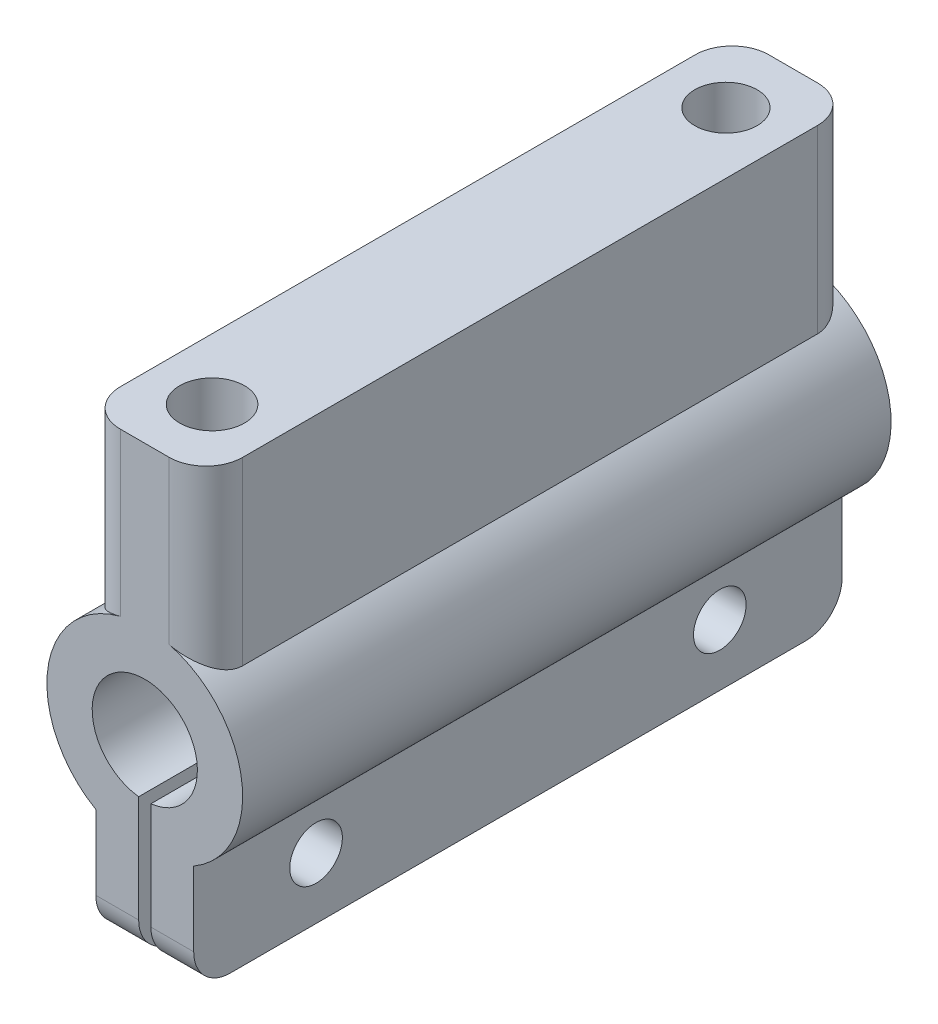
ISO-10303-21;
HEADER;
FILE_DESCRIPTION(('STEP AP214'),'2;1');
FILE_NAME('part.step','',(''),(''),'','','');
FILE_SCHEMA(('AUTOMOTIVE_DESIGN { 1 0 10303 214 1 1 1 1 }'));
ENDSEC;
DATA;
#1=APPLICATION_CONTEXT('core data for automotive mechanical design processes');
#2=APPLICATION_PROTOCOL_DEFINITION('international standard','automotive_design',2000,#1);
#3=PRODUCT_CONTEXT('',#1,'mechanical');
#4=PRODUCT('Part','Part','',(#3));
#5=PRODUCT_RELATED_PRODUCT_CATEGORY('part','',(#4));
#6=PRODUCT_DEFINITION_FORMATION('','',#4);
#7=PRODUCT_DEFINITION_CONTEXT('part definition',#1,'design');
#8=PRODUCT_DEFINITION('design','',#6,#7);
#9=PRODUCT_DEFINITION_SHAPE('','',#8);
#10=(LENGTH_UNIT() NAMED_UNIT(*) SI_UNIT(.MILLI.,.METRE.));
#11=(NAMED_UNIT(*) PLANE_ANGLE_UNIT() SI_UNIT($,.RADIAN.));
#12=(NAMED_UNIT(*) SI_UNIT($,.STERADIAN.) SOLID_ANGLE_UNIT());
#13=UNCERTAINTY_MEASURE_WITH_UNIT(LENGTH_MEASURE(1.E-05),#10,'distance_accuracy_value','');
#14=(GEOMETRIC_REPRESENTATION_CONTEXT(3) GLOBAL_UNCERTAINTY_ASSIGNED_CONTEXT((#13)) GLOBAL_UNIT_ASSIGNED_CONTEXT((#10,
#11,#12)) REPRESENTATION_CONTEXT('',''));
#15=CARTESIAN_POINT('',(0.,0.,0.));
#16=DIRECTION('',(0.,0.,1.));
#17=DIRECTION('',(1.,0.,0.));
#18=AXIS2_PLACEMENT_3D('',#15,#16,#17);
#19=CARTESIAN_POINT('',(-9.00000000000001,0.,53.));
#20=DIRECTION('',(1.,0.,0.));
#21=DIRECTION('',(0.,0.,-1.));
#22=AXIS2_PLACEMENT_3D('',#19,#20,#21);
#23=PLANE('',#22);
#24=DIRECTION('',(0.,0.,-1.));
#25=VECTOR('',#24,1.);
#26=CARTESIAN_POINT('',(-9.00000000000001,31.2449979983984,53.));
#27=LINE('',#26,#25);
#28=CARTESIAN_POINT('',(-9.00000000000001,31.2449979983984,50.));
#29=VERTEX_POINT('',#28);
#30=CARTESIAN_POINT('',(-9.00000000000001,31.2449979983984,3.));
#31=VERTEX_POINT('',#30);
#32=EDGE_CURVE('E204',#29,#31,#27,.T.);
#33=ORIENTED_EDGE('',*,*,#32,.F.);
#34=DIRECTION('',(0.,-1.,0.));
#35=VECTOR('',#34,1.);
#36=CARTESIAN_POINT('',(-9.00000000000001,45.9999979983984,50.));
#37=LINE('',#36,#35);
#38=CARTESIAN_POINT('',(-9.00000000000001,45.9999979983984,50.));
#39=VERTEX_POINT('',#38);
#40=EDGE_CURVE('E297',#29,#39,#37,.F.);
#41=ORIENTED_EDGE('',*,*,#40,.T.);
#42=DIRECTION('',(0.,0.,-1.));
#43=VECTOR('',#42,1.);
#44=CARTESIAN_POINT('',(-9.00000000000001,45.9999979983984,53.));
#45=LINE('',#44,#43);
#46=CARTESIAN_POINT('',(-9.00000000000001,45.9999979983984,3.));
#47=VERTEX_POINT('',#46);
#48=EDGE_CURVE('E226',#39,#47,#45,.T.);
#49=ORIENTED_EDGE('',*,*,#48,.T.);
#50=DIRECTION('',(0.,-1.,0.));
#51=VECTOR('',#50,1.);
#52=CARTESIAN_POINT('',(-9.00000000000001,0.,3.));
#53=LINE('',#52,#51);
#54=EDGE_CURVE('E294',#47,#31,#53,.T.);
#55=ORIENTED_EDGE('',*,*,#54,.T.);
#56=EDGE_LOOP('',(#33,#41,#49,#55));
#57=FACE_BOUND('',#56,.T.);
#58=ADVANCED_FACE('F37',(#57),#23,.F.);
#59=CARTESIAN_POINT('',(-4.,25.,53.));
#60=DIRECTION('',(0.,0.,-1.));
#61=DIRECTION('',(-1.,0.,0.));
#62=AXIS2_PLACEMENT_3D('',#59,#60,#61);
#63=CYLINDRICAL_SURFACE('',#62,8.);
#64=CARTESIAN_POINT('',(-4.,25.,0.));
#65=DIRECTION('',(0.,0.,1.));
#66=DIRECTION('',(1.,0.,0.));
#67=AXIS2_PLACEMENT_3D('',#64,#65,#66);
#68=CIRCLE('',#67,8.);
#69=CARTESIAN_POINT('',(-6.00000000000001,32.7459666924148,0.));
#70=VERTEX_POINT('',#69);
#71=CARTESIAN_POINT('',(-8.,18.0717967697245,0.));
#72=VERTEX_POINT('',#71);
#73=EDGE_CURVE('E200',#70,#72,#68,.T.);
#74=ORIENTED_EDGE('',*,*,#73,.T.);
#75=DIRECTION('',(0.,0.,-1.));
#76=VECTOR('',#75,1.);
#77=CARTESIAN_POINT('',(-8.,18.0717967697245,53.));
#78=LINE('',#77,#76);
#79=CARTESIAN_POINT('',(-8.,18.0717967697245,53.));
#80=VERTEX_POINT('',#79);
#81=EDGE_CURVE('E198',#80,#72,#78,.T.);
#82=ORIENTED_EDGE('',*,*,#81,.F.);
#83=CARTESIAN_POINT('',(-4.,25.,53.));
#84=DIRECTION('',(0.,0.,1.));
#85=DIRECTION('',(1.,0.,0.));
#86=AXIS2_PLACEMENT_3D('',#83,#84,#85);
#87=CIRCLE('',#86,8.);
#88=CARTESIAN_POINT('',(-6.00000000000001,32.7459666924148,53.));
#89=VERTEX_POINT('',#88);
#90=EDGE_CURVE('E182',#89,#80,#87,.T.);
#91=ORIENTED_EDGE('',*,*,#90,.F.);
#92=CARTESIAN_POINT('',(-6.00000000000001,32.7459666924148,53.));
#93=CARTESIAN_POINT('',(-6.08773920479676,32.7233272992637,53.0000092646852));
#94=CARTESIAN_POINT('',(-6.1750617421687,32.6991763694348,52.9961516313754));
#95=CARTESIAN_POINT('',(-6.3481896559099,32.6481425128384,52.9809888221022));
#96=CARTESIAN_POINT('',(-6.43399600588946,32.6212614200694,52.9696886180943));
#97=CARTESIAN_POINT('',(-6.60311662383125,32.5651633208365,52.9399981360294));
#98=CARTESIAN_POINT('',(-6.6864409357416,32.5359582379294,52.9216424054451));
#99=CARTESIAN_POINT('',(-6.85050819438618,32.4754439062559,52.8781668477752));
#100=CARTESIAN_POINT('',(-6.93125074133637,32.4441343339174,52.853045978734));
#101=CARTESIAN_POINT('',(-7.16851342379634,32.3477555053629,52.7681601746403));
#102=CARTESIAN_POINT('',(-7.32063489925194,32.2800456356622,52.6987694445046));
#103=CARTESIAN_POINT('',(-7.61024490583445,32.1408733891751,52.5366812388086));
#104=CARTESIAN_POINT('',(-7.74770582160459,32.069404296509,52.4439408471977));
#105=CARTESIAN_POINT('',(-8.01662064033845,31.9204272090123,52.228322511407));
#106=CARTESIAN_POINT('',(-8.14656565444551,31.8429233417674,52.1035504159153));
#107=CARTESIAN_POINT('',(-8.38342824114675,31.6936642691195,51.8308053573937));
#108=CARTESIAN_POINT('',(-8.49036088607239,31.6219053204501,51.682847690571));
#109=CARTESIAN_POINT('',(-8.65772571017001,31.5049018745633,51.3991488652802));
#110=CARTESIAN_POINT('',(-8.72320767204108,31.4572548800995,51.2673804472049));
#111=CARTESIAN_POINT('',(-8.83488570275547,31.3740681574211,50.9926192369394));
#112=CARTESIAN_POINT('',(-8.88113950524331,31.3384922450937,50.8496615998015));
#113=CARTESIAN_POINT('',(-8.9438884970151,31.2896083940171,50.5891744858785));
#114=CARTESIAN_POINT('',(-8.96477209209323,31.2730672280996,50.4733154370658));
#115=CARTESIAN_POINT('',(-8.98582537968396,31.2563263360813,50.2972775182239));
#116=CARTESIAN_POINT('',(-8.99113143965948,31.2520907446943,50.2380516237506));
#117=CARTESIAN_POINT('',(-8.99822194891451,31.2464219222498,50.1192241703619));
#118=CARTESIAN_POINT('',(-9.0000044771574,31.2449902198822,50.0596224242847));
#119=CARTESIAN_POINT('',(-9.00000000000001,31.2449979983984,50.));
#120=B_SPLINE_CURVE_WITH_KNOTS('',3,(#92,#93,#94,#95,#96,#97,#98,#99,#100,#101,#102,#103,#104,
#105,#106,#107,#108,#109,#110,#111,#112,#113,#114,#115,#116,#117,#118,#119),.UNSPECIFIED.,.F.,
.F.,(4,2,2,2,2,2,2,2,2,2,2,2,2,4),(0.,0.271704608587919,0.543227890733964,0.813438252305687,
1.083690255055,1.62239735914839,2.16210191418487,2.7477756717573,3.33306465722395,
3.79528746396618,4.25611221753983,4.61144683328493,4.79013358262795,4.96891772550683),.UNSPECIFIED.);
#121=EDGE_CURVE('E339',#89,#29,#120,.T.);
#122=ORIENTED_EDGE('',*,*,#121,.T.);
#123=ORIENTED_EDGE('',*,*,#32,.T.);
#124=CARTESIAN_POINT('',(-9.00000000000001,31.2449979983984,3.));
#125=CARTESIAN_POINT('',(-9.00001685431487,31.2449727724931,2.92627562918404));
#126=CARTESIAN_POINT('',(-8.9972830070575,31.2471731178525,2.85256747585415));
#127=CARTESIAN_POINT('',(-8.98644618458767,31.255832575188,2.70586145123003));
#128=CARTESIAN_POINT('',(-8.97834790583528,31.26228796193,2.63286301526344));
#129=CARTESIAN_POINT('',(-8.95699939298203,31.2791981639824,2.48869934945516));
#130=CARTESIAN_POINT('',(-8.9437906870578,31.2896207305514,2.41752415189258));
#131=CARTESIAN_POINT('',(-8.91244759637194,31.3141313661867,2.27692111161412));
#132=CARTESIAN_POINT('',(-8.89431237289392,31.3282200593767,2.20749356862928));
#133=CARTESIAN_POINT('',(-8.83303261896774,31.3753001022847,2.00295456474151));
#134=CARTESIAN_POINT('',(-8.78292115652974,31.4131819450177,1.8709800487456));
#135=CARTESIAN_POINT('',(-8.66625166512134,31.4985620469191,1.6177422109068));
#136=CARTESIAN_POINT('',(-8.59965947606226,31.5460802422211,1.49650185586121));
#137=CARTESIAN_POINT('',(-8.44356880119236,31.6531668152854,1.25294596503357));
#138=CARTESIAN_POINT('',(-8.3523241459676,31.7134914119965,1.13208447459395));
#139=CARTESIAN_POINT('',(-8.15397220593471,31.8380001070527,0.906439384772301));
#140=CARTESIAN_POINT('',(-8.04685593303027,31.9021863799511,0.801664964404561));
#141=CARTESIAN_POINT('',(-7.79727774025293,32.0430690858522,0.591448644991847));
#142=CARTESIAN_POINT('',(-7.65194355231391,32.1198814968461,0.489474678145037));
#143=CARTESIAN_POINT('',(-7.34407485768076,32.2695495753283,0.312076146553971));
#144=CARTESIAN_POINT('',(-7.18155622742209,32.3424088025253,0.236627349628639));
#145=CARTESIAN_POINT('',(-6.93284976397562,32.4435073271098,0.147470085435939));
#146=CARTESIAN_POINT('',(-6.85192161621563,32.4749074298509,0.12224490430998));
#147=CARTESIAN_POINT('',(-6.68746984543456,32.5355936357613,0.0785936105346655));
#148=CARTESIAN_POINT('',(-6.60394673618947,32.5648801536313,0.0601661611878112));
#149=CARTESIAN_POINT('',(-6.43452415028572,32.6210940046591,0.0303856168194937));
#150=CARTESIAN_POINT('',(-6.34861723092502,32.6480125082481,0.0190581075546224));
#151=CARTESIAN_POINT('',(-6.17528023260102,32.6991159472361,0.00385803194383762));
#152=CARTESIAN_POINT('',(-6.08784911732043,32.7232989318327,-9.2453876697896E-06));
#153=CARTESIAN_POINT('',(-6.00000000000001,32.7459666924148,0.));
#154=B_SPLINE_CURVE_WITH_KNOTS('',3,(#124,#125,#126,#127,#128,#129,#130,#131,#132,#133,#134,
#135,#136,#137,#138,#139,#140,#141,#142,#143,#144,#145,#146,#147,#148,#149,#150,#151,#152,#153),
.UNSPECIFIED.,.F.,.F.,(4,2,2,2,2,2,2,2,2,2,2,2,2,2,4),(0.,0.221063297153099,0.44193331283448,
0.661044973484265,0.880193960264031,1.31666039164947,1.75403918992804,2.24129524107008,
2.72882828741264,3.306625443354,3.8838933701821,4.15482749366773,4.42570831257028,
4.69755976418581,4.96960387718176),.UNSPECIFIED.);
#155=EDGE_CURVE('E11',#31,#70,#154,.T.);
#156=ORIENTED_EDGE('',*,*,#155,.T.);
#157=EDGE_LOOP('',(#74,#82,#91,#122,#123,#156));
#158=FACE_BOUND('',#157,.T.);
#159=ADVANCED_FACE('F199',(#158),#63,.T.);
#160=CARTESIAN_POINT('',(-8.,0.,53.));
#161=DIRECTION('',(1.,0.,0.));
#162=DIRECTION('',(0.,1.,0.));
#163=AXIS2_PLACEMENT_3D('',#160,#161,#162);
#164=PLANE('',#163);
#165=CARTESIAN_POINT('',(-8.,14.,43.));
#166=DIRECTION('',(1.,0.,0.));
#167=DIRECTION('',(0.,1.,0.));
#168=AXIS2_PLACEMENT_3D('',#165,#166,#167);
#169=CIRCLE('',#168,2.15);
#170=CARTESIAN_POINT('',(-8.,16.15,43.));
#171=VERTEX_POINT('',#170);
#172=EDGE_CURVE('E229',#171,#171,#169,.T.);
#173=ORIENTED_EDGE('',*,*,#172,.T.);
#174=EDGE_LOOP('',(#173));
#175=FACE_BOUND('',#174,.T.);
#176=CARTESIAN_POINT('',(-8.,14.,10.));
#177=DIRECTION('',(1.,0.,0.));
#178=DIRECTION('',(0.,1.,0.));
#179=AXIS2_PLACEMENT_3D('',#176,#177,#178);
#180=CIRCLE('',#179,2.15);
#181=CARTESIAN_POINT('',(-8.,16.15,10.));
#182=VERTEX_POINT('',#181);
#183=EDGE_CURVE('E705',#182,#182,#180,.T.);
#184=ORIENTED_EDGE('',*,*,#183,.T.);
#185=EDGE_LOOP('',(#184));
#186=FACE_BOUND('',#185,.T.);
#187=DIRECTION('',(0.,-1.,0.));
#188=VECTOR('',#187,1.);
#189=CARTESIAN_POINT('',(-8.,0.,0.));
#190=LINE('',#189,#188);
#191=CARTESIAN_POINT('',(-8.,12.,0.));
#192=VERTEX_POINT('',#191);
#193=EDGE_CURVE('E228',#72,#192,#190,.T.);
#194=ORIENTED_EDGE('',*,*,#193,.T.);
#195=CARTESIAN_POINT('',(-8.,12.,3.));
#196=DIRECTION('',(1.,0.,0.));
#197=DIRECTION('',(0.,1.,0.));
#198=AXIS2_PLACEMENT_3D('',#195,#196,#197);
#199=CIRCLE('',#198,3.);
#200=CARTESIAN_POINT('',(-8.,9.,3.));
#201=VERTEX_POINT('',#200);
#202=EDGE_CURVE('E318',#192,#201,#199,.F.);
#203=ORIENTED_EDGE('',*,*,#202,.T.);
#204=DIRECTION('',(0.,0.,-1.));
#205=VECTOR('',#204,1.);
#206=CARTESIAN_POINT('',(-8.,9.,53.));
#207=LINE('',#206,#205);
#208=CARTESIAN_POINT('',(-8.,9.,50.));
#209=VERTEX_POINT('',#208);
#210=EDGE_CURVE('E205',#209,#201,#207,.T.);
#211=ORIENTED_EDGE('',*,*,#210,.F.);
#212=CARTESIAN_POINT('',(-8.,12.,50.));
#213=DIRECTION('',(1.,0.,0.));
#214=DIRECTION('',(0.,1.,0.));
#215=AXIS2_PLACEMENT_3D('',#212,#213,#214);
#216=CIRCLE('',#215,3.);
#217=CARTESIAN_POINT('',(-8.,12.,53.));
#218=VERTEX_POINT('',#217);
#219=EDGE_CURVE('E210',#209,#218,#216,.F.);
#220=ORIENTED_EDGE('',*,*,#219,.T.);
#221=DIRECTION('',(0.,-1.,0.));
#222=VECTOR('',#221,1.);
#223=CARTESIAN_POINT('',(-8.,0.,53.));
#224=LINE('',#223,#222);
#225=EDGE_CURVE('E187',#80,#218,#224,.T.);
#226=ORIENTED_EDGE('',*,*,#225,.F.);
#227=ORIENTED_EDGE('',*,*,#81,.T.);
#228=EDGE_LOOP('',(#194,#203,#211,#220,#226,#227));
#229=FACE_BOUND('',#228,.T.);
#230=ADVANCED_FACE('F207',(#175,#186,#229),#164,.F.);
#231=CARTESIAN_POINT('',(0.,9.,53.));
#232=DIRECTION('',(0.,1.,0.));
#233=DIRECTION('',(-1.,0.,0.));
#234=AXIS2_PLACEMENT_3D('',#231,#232,#233);
#235=PLANE('',#234);
#236=ORIENTED_EDGE('',*,*,#210,.T.);
#237=DIRECTION('',(1.,0.,0.));
#238=VECTOR('',#237,1.);
#239=CARTESIAN_POINT('',(0.,9.,3.));
#240=LINE('',#239,#238);
#241=CARTESIAN_POINT('',(-4.49999999999999,9.,3.));
#242=VERTEX_POINT('',#241);
#243=EDGE_CURVE('E310',#201,#242,#240,.T.);
#244=ORIENTED_EDGE('',*,*,#243,.T.);
#245=DIRECTION('',(0.,0.,-1.));
#246=VECTOR('',#245,1.);
#247=CARTESIAN_POINT('',(-4.49999999999999,9.,53.));
#248=LINE('',#247,#246);
#249=CARTESIAN_POINT('',(-4.49999999999999,9.,50.));
#250=VERTEX_POINT('',#249);
#251=EDGE_CURVE('E265',#250,#242,#248,.T.);
#252=ORIENTED_EDGE('',*,*,#251,.F.);
#253=DIRECTION('',(1.,0.,0.));
#254=VECTOR('',#253,1.);
#255=CARTESIAN_POINT('',(-8.,9.,50.));
#256=LINE('',#255,#254);
#257=EDGE_CURVE('E308',#250,#209,#256,.F.);
#258=ORIENTED_EDGE('',*,*,#257,.T.);
#259=EDGE_LOOP('',(#236,#244,#252,#258));
#260=FACE_BOUND('',#259,.T.);
#261=ADVANCED_FACE('F415',(#260),#235,.F.);
#262=CARTESIAN_POINT('',(-4.49999999999999,0.,53.));
#263=DIRECTION('',(-1.,0.,0.));
#264=DIRECTION('',(0.,-1.,0.));
#265=AXIS2_PLACEMENT_3D('',#262,#263,#264);
#266=PLANE('',#265);
#267=CARTESIAN_POINT('',(-4.5,14.,43.));
#268=DIRECTION('',(-1.,0.,0.));
#269=DIRECTION('',(0.,-1.,0.));
#270=AXIS2_PLACEMENT_3D('',#267,#268,#269);
#271=CIRCLE('',#270,2.15);
#272=CARTESIAN_POINT('',(-4.5,11.85,43.));
#273=VERTEX_POINT('',#272);
#274=EDGE_CURVE('E711',#273,#273,#271,.T.);
#275=ORIENTED_EDGE('',*,*,#274,.T.);
#276=EDGE_LOOP('',(#275));
#277=FACE_BOUND('',#276,.T.);
#278=CARTESIAN_POINT('',(-4.5,14.,10.));
#279=DIRECTION('',(-1.,0.,0.));
#280=DIRECTION('',(0.,-1.,0.));
#281=AXIS2_PLACEMENT_3D('',#278,#279,#280);
#282=CIRCLE('',#281,2.15);
#283=CARTESIAN_POINT('',(-4.5,11.85,10.));
#284=VERTEX_POINT('',#283);
#285=EDGE_CURVE('E702',#284,#284,#282,.T.);
#286=ORIENTED_EDGE('',*,*,#285,.T.);
#287=EDGE_LOOP('',(#286));
#288=FACE_BOUND('',#287,.T.);
#289=ORIENTED_EDGE('',*,*,#251,.T.);
#290=CARTESIAN_POINT('',(-4.5,12.,3.));
#291=DIRECTION('',(-1.,0.,0.));
#292=DIRECTION('',(0.,-1.,0.));
#293=AXIS2_PLACEMENT_3D('',#290,#291,#292);
#294=CIRCLE('',#293,3.);
#295=CARTESIAN_POINT('',(-4.5,12.,0.));
#296=VERTEX_POINT('',#295);
#297=EDGE_CURVE('E315',#242,#296,#294,.F.);
#298=ORIENTED_EDGE('',*,*,#297,.T.);
#299=DIRECTION('',(0.,1.,0.));
#300=VECTOR('',#299,1.);
#301=CARTESIAN_POINT('',(-4.49999999999999,0.,0.));
#302=LINE('',#301,#300);
#303=CARTESIAN_POINT('',(-4.5,20.7291686991875,0.));
#304=VERTEX_POINT('',#303);
#305=EDGE_CURVE('E232',#296,#304,#302,.T.);
#306=ORIENTED_EDGE('',*,*,#305,.T.);
#307=DIRECTION('',(0.,0.,-1.));
#308=VECTOR('',#307,1.);
#309=CARTESIAN_POINT('',(-4.5,20.7291686991875,53.));
#310=LINE('',#309,#308);
#311=CARTESIAN_POINT('',(-4.5,20.7291686991875,53.));
#312=VERTEX_POINT('',#311);
#313=EDGE_CURVE('E262',#312,#304,#310,.T.);
#314=ORIENTED_EDGE('',*,*,#313,.F.);
#315=DIRECTION('',(0.,1.,0.));
#316=VECTOR('',#315,1.);
#317=CARTESIAN_POINT('',(-4.49999999999999,0.,53.));
#318=LINE('',#317,#316);
#319=CARTESIAN_POINT('',(-4.5,12.,53.));
#320=VERTEX_POINT('',#319);
#321=EDGE_CURVE('E211',#320,#312,#318,.T.);
#322=ORIENTED_EDGE('',*,*,#321,.F.);
#323=CARTESIAN_POINT('',(-4.5,12.,50.));
#324=DIRECTION('',(-1.,0.,0.));
#325=DIRECTION('',(0.,-1.,0.));
#326=AXIS2_PLACEMENT_3D('',#323,#324,#325);
#327=CIRCLE('',#326,3.);
#328=EDGE_CURVE('E313',#320,#250,#327,.F.);
#329=ORIENTED_EDGE('',*,*,#328,.T.);
#330=EDGE_LOOP('',(#289,#298,#306,#314,#322,#329));
#331=FACE_BOUND('',#330,.T.);
#332=ADVANCED_FACE('F452',(#277,#288,#331),#266,.F.);
#333=CARTESIAN_POINT('',(-4.,25.,53.));
#334=DIRECTION('',(0.,0.,-1.));
#335=DIRECTION('',(-1.,0.,0.));
#336=AXIS2_PLACEMENT_3D('',#333,#334,#335);
#337=CYLINDRICAL_SURFACE('',#336,4.3);
#338=CARTESIAN_POINT('',(-4.,25.,0.));
#339=DIRECTION('',(0.,0.,1.));
#340=DIRECTION('',(1.,0.,0.));
#341=AXIS2_PLACEMENT_3D('',#338,#339,#340);
#342=CIRCLE('',#341,4.3);
#343=CARTESIAN_POINT('',(-3.5,20.7291686991875,0.));
#344=VERTEX_POINT('',#343);
#345=EDGE_CURVE('E234',#344,#304,#342,.T.);
#346=ORIENTED_EDGE('',*,*,#345,.F.);
#347=DIRECTION('',(0.,0.,-1.));
#348=VECTOR('',#347,1.);
#349=CARTESIAN_POINT('',(-3.5,20.7291686991875,53.));
#350=LINE('',#349,#348);
#351=CARTESIAN_POINT('',(-3.5,20.7291686991875,53.));
#352=VERTEX_POINT('',#351);
#353=EDGE_CURVE('E259',#352,#344,#350,.T.);
#354=ORIENTED_EDGE('',*,*,#353,.F.);
#355=CARTESIAN_POINT('',(-4.,25.,53.));
#356=DIRECTION('',(0.,0.,1.));
#357=DIRECTION('',(1.,0.,0.));
#358=AXIS2_PLACEMENT_3D('',#355,#356,#357);
#359=CIRCLE('',#358,4.3);
#360=EDGE_CURVE('E213',#352,#312,#359,.T.);
#361=ORIENTED_EDGE('',*,*,#360,.T.);
#362=ORIENTED_EDGE('',*,*,#313,.T.);
#363=EDGE_LOOP('',(#346,#354,#361,#362));
#364=FACE_BOUND('',#363,.T.);
#365=ADVANCED_FACE('F439',(#364),#337,.F.);
#366=CARTESIAN_POINT('',(-3.49999999999999,0.,53.));
#367=DIRECTION('',(-1.,0.,0.));
#368=DIRECTION('',(0.,-1.,0.));
#369=AXIS2_PLACEMENT_3D('',#366,#367,#368);
#370=PLANE('',#369);
#371=CARTESIAN_POINT('',(-3.5,14.,43.));
#372=DIRECTION('',(-1.,0.,0.));
#373=DIRECTION('',(0.,-1.,0.));
#374=AXIS2_PLACEMENT_3D('',#371,#372,#373);
#375=CIRCLE('',#374,2.15);
#376=CARTESIAN_POINT('',(-3.5,11.85,43.));
#377=VERTEX_POINT('',#376);
#378=EDGE_CURVE('E708',#377,#377,#375,.T.);
#379=ORIENTED_EDGE('',*,*,#378,.F.);
#380=EDGE_LOOP('',(#379));
#381=FACE_BOUND('',#380,.T.);
#382=CARTESIAN_POINT('',(-3.5,14.,10.));
#383=DIRECTION('',(-1.,0.,0.));
#384=DIRECTION('',(0.,-1.,0.));
#385=AXIS2_PLACEMENT_3D('',#382,#383,#384);
#386=CIRCLE('',#385,2.15);
#387=CARTESIAN_POINT('',(-3.5,11.85,10.));
#388=VERTEX_POINT('',#387);
#389=EDGE_CURVE('E686',#388,#388,#386,.T.);
#390=ORIENTED_EDGE('',*,*,#389,.F.);
#391=EDGE_LOOP('',(#390));
#392=FACE_BOUND('',#391,.T.);
#393=DIRECTION('',(0.,1.,0.));
#394=VECTOR('',#393,1.);
#395=CARTESIAN_POINT('',(-3.49999999999999,0.,0.));
#396=LINE('',#395,#394);
#397=CARTESIAN_POINT('',(-3.5,12.,0.));
#398=VERTEX_POINT('',#397);
#399=EDGE_CURVE('E237',#398,#344,#396,.T.);
#400=ORIENTED_EDGE('',*,*,#399,.F.);
#401=CARTESIAN_POINT('',(-3.5,12.,3.));
#402=DIRECTION('',(-1.,0.,0.));
#403=DIRECTION('',(0.,-1.,0.));
#404=AXIS2_PLACEMENT_3D('',#401,#402,#403);
#405=CIRCLE('',#404,3.);
#406=CARTESIAN_POINT('',(-3.5,9.,3.));
#407=VERTEX_POINT('',#406);
#408=EDGE_CURVE('E58',#398,#407,#405,.T.);
#409=ORIENTED_EDGE('',*,*,#408,.T.);
#410=DIRECTION('',(0.,0.,-1.));
#411=VECTOR('',#410,1.);
#412=CARTESIAN_POINT('',(-3.5,9.,53.));
#413=LINE('',#412,#411);
#414=CARTESIAN_POINT('',(-3.5,9.,50.));
#415=VERTEX_POINT('',#414);
#416=EDGE_CURVE('E257',#415,#407,#413,.T.);
#417=ORIENTED_EDGE('',*,*,#416,.F.);
#418=CARTESIAN_POINT('',(-3.5,12.,50.));
#419=DIRECTION('',(-1.,0.,0.));
#420=DIRECTION('',(0.,-1.,0.));
#421=AXIS2_PLACEMENT_3D('',#418,#419,#420);
#422=CIRCLE('',#421,3.);
#423=CARTESIAN_POINT('',(-3.5,12.,53.));
#424=VERTEX_POINT('',#423);
#425=EDGE_CURVE('E328',#415,#424,#422,.T.);
#426=ORIENTED_EDGE('',*,*,#425,.T.);
#427=DIRECTION('',(0.,1.,0.));
#428=VECTOR('',#427,1.);
#429=CARTESIAN_POINT('',(-3.49999999999999,0.,53.));
#430=LINE('',#429,#428);
#431=EDGE_CURVE('E219',#424,#352,#430,.T.);
#432=ORIENTED_EDGE('',*,*,#431,.T.);
#433=ORIENTED_EDGE('',*,*,#353,.T.);
#434=EDGE_LOOP('',(#400,#409,#417,#426,#432,#433));
#435=FACE_BOUND('',#434,.T.);
#436=ADVANCED_FACE('F431',(#381,#392,#435),#370,.T.);
#437=CARTESIAN_POINT('',(0.,9.,53.));
#438=DIRECTION('',(0.,1.,0.));
#439=DIRECTION('',(-1.,0.,0.));
#440=AXIS2_PLACEMENT_3D('',#437,#438,#439);
#441=PLANE('',#440);
#442=ORIENTED_EDGE('',*,*,#416,.T.);
#443=DIRECTION('',(1.,0.,0.));
#444=VECTOR('',#443,1.);
#445=CARTESIAN_POINT('',(0.,9.,3.));
#446=LINE('',#445,#444);
#447=CARTESIAN_POINT('',(0.,9.,3.));
#448=VERTEX_POINT('',#447);
#449=EDGE_CURVE('E321',#407,#448,#446,.T.);
#450=ORIENTED_EDGE('',*,*,#449,.T.);
#451=DIRECTION('',(0.,0.,-1.));
#452=VECTOR('',#451,1.);
#453=CARTESIAN_POINT('',(0.,9.,53.));
#454=LINE('',#453,#452);
#455=CARTESIAN_POINT('',(0.,9.,50.));
#456=VERTEX_POINT('',#455);
#457=EDGE_CURVE('E254',#456,#448,#454,.T.);
#458=ORIENTED_EDGE('',*,*,#457,.F.);
#459=DIRECTION('',(1.,0.,0.));
#460=VECTOR('',#459,1.);
#461=CARTESIAN_POINT('',(-3.5,9.,50.));
#462=LINE('',#461,#460);
#463=EDGE_CURVE('E65',#456,#415,#462,.F.);
#464=ORIENTED_EDGE('',*,*,#463,.T.);
#465=EDGE_LOOP('',(#442,#450,#458,#464));
#466=FACE_BOUND('',#465,.T.);
#467=ADVANCED_FACE('F423',(#466),#441,.F.);
#468=CARTESIAN_POINT('',(0.,0.,53.));
#469=DIRECTION('',(1.,0.,0.));
#470=DIRECTION('',(0.,1.,0.));
#471=AXIS2_PLACEMENT_3D('',#468,#469,#470);
#472=PLANE('',#471);
#473=CARTESIAN_POINT('',(0.,14.,43.));
#474=DIRECTION('',(1.,0.,0.));
#475=DIRECTION('',(0.,1.,0.));
#476=AXIS2_PLACEMENT_3D('',#473,#474,#475);
#477=CIRCLE('',#476,2.15);
#478=CARTESIAN_POINT('',(0.,16.15,43.));
#479=VERTEX_POINT('',#478);
#480=EDGE_CURVE('E691',#479,#479,#477,.T.);
#481=ORIENTED_EDGE('',*,*,#480,.F.);
#482=EDGE_LOOP('',(#481));
#483=FACE_BOUND('',#482,.T.);
#484=CARTESIAN_POINT('',(0.,14.,10.));
#485=DIRECTION('',(1.,0.,0.));
#486=DIRECTION('',(0.,-1.,0.));
#487=AXIS2_PLACEMENT_3D('',#484,#485,#486);
#488=CIRCLE('',#487,2.15);
#489=CARTESIAN_POINT('',(0.,11.85,10.));
#490=VERTEX_POINT('',#489);
#491=EDGE_CURVE('E689',#490,#490,#488,.T.);
#492=ORIENTED_EDGE('',*,*,#491,.F.);
#493=EDGE_LOOP('',(#492));
#494=FACE_BOUND('',#493,.T.);
#495=ORIENTED_EDGE('',*,*,#457,.T.);
#496=CARTESIAN_POINT('',(0.,12.,3.));
#497=DIRECTION('',(1.,0.,0.));
#498=DIRECTION('',(0.,1.,0.));
#499=AXIS2_PLACEMENT_3D('',#496,#497,#498);
#500=CIRCLE('',#499,3.);
#501=CARTESIAN_POINT('',(0.,12.,0.));
#502=VERTEX_POINT('',#501);
#503=EDGE_CURVE('E326',#448,#502,#500,.T.);
#504=ORIENTED_EDGE('',*,*,#503,.T.);
#505=DIRECTION('',(0.,-1.,0.));
#506=VECTOR('',#505,1.);
#507=CARTESIAN_POINT('',(0.,0.,0.));
#508=LINE('',#507,#506);
#509=CARTESIAN_POINT('',(0.,18.0717967697245,0.));
#510=VERTEX_POINT('',#509);
#511=EDGE_CURVE('E239',#510,#502,#508,.T.);
#512=ORIENTED_EDGE('',*,*,#511,.F.);
#513=DIRECTION('',(0.,0.,-1.));
#514=VECTOR('',#513,1.);
#515=CARTESIAN_POINT('',(0.,18.0717967697245,53.));
#516=LINE('',#515,#514);
#517=CARTESIAN_POINT('',(0.,18.0717967697245,53.));
#518=VERTEX_POINT('',#517);
#519=EDGE_CURVE('E252',#518,#510,#516,.T.);
#520=ORIENTED_EDGE('',*,*,#519,.F.);
#521=DIRECTION('',(0.,-1.,0.));
#522=VECTOR('',#521,1.);
#523=CARTESIAN_POINT('',(0.,0.,53.));
#524=LINE('',#523,#522);
#525=CARTESIAN_POINT('',(0.,12.,53.));
#526=VERTEX_POINT('',#525);
#527=EDGE_CURVE('E221',#518,#526,#524,.T.);
#528=ORIENTED_EDGE('',*,*,#527,.T.);
#529=CARTESIAN_POINT('',(0.,12.,50.));
#530=DIRECTION('',(1.,0.,0.));
#531=DIRECTION('',(0.,1.,0.));
#532=AXIS2_PLACEMENT_3D('',#529,#530,#531);
#533=CIRCLE('',#532,3.);
#534=EDGE_CURVE('E324',#526,#456,#533,.T.);
#535=ORIENTED_EDGE('',*,*,#534,.T.);
#536=EDGE_LOOP('',(#495,#504,#512,#520,#528,#535));
#537=FACE_BOUND('',#536,.T.);
#538=ADVANCED_FACE('F418',(#483,#494,#537),#472,.T.);
#539=CARTESIAN_POINT('',(-2.,32.7459666924148,0.));
#540=VERTEX_POINT('',#539);
#541=EDGE_CURVE('E230',#510,#540,#68,.T.);
#542=ORIENTED_EDGE('',*,*,#541,.T.);
#543=CARTESIAN_POINT('',(-2.,32.7459666924148,0.));
#544=CARTESIAN_POINT('',(-1.91226079520326,32.7233272992637,-9.26468524033459E-06));
#545=CARTESIAN_POINT('',(-1.82493825783131,32.6991763694348,0.00384836862461216));
#546=CARTESIAN_POINT('',(-1.65181034409011,32.6481425128384,0.0190111778978282));
#547=CARTESIAN_POINT('',(-1.56600399411055,32.6212614200694,0.0303113819056787));
#548=CARTESIAN_POINT('',(-1.39688337616876,32.5651633208365,0.0600018639706248));
#549=CARTESIAN_POINT('',(-1.31355906425842,32.5359582379294,0.0783575945548462));
#550=CARTESIAN_POINT('',(-1.14949180561383,32.4754439062559,0.121833152224843));
#551=CARTESIAN_POINT('',(-1.06874925866365,32.4441343339174,0.146954021266041));
#552=CARTESIAN_POINT('',(-0.831486576203679,32.3477555053629,0.231839825359737));
#553=CARTESIAN_POINT('',(-0.679365100748071,32.2800456356622,0.301230555495375));
#554=CARTESIAN_POINT('',(-0.389755094165565,32.1408733891751,0.463318761191391));
#555=CARTESIAN_POINT('',(-0.252294178395426,32.069404296509,0.556059152802297));
#556=CARTESIAN_POINT('',(0.0166206403384393,31.9204272090124,0.771677488593042));
#557=CARTESIAN_POINT('',(0.146565654445499,31.8429233417674,0.8964495840847));
#558=CARTESIAN_POINT('',(0.383428241146736,31.6936642691195,1.16919464260631));
#559=CARTESIAN_POINT('',(0.490360886072378,31.6219053204501,1.31715230942902));
#560=CARTESIAN_POINT('',(0.657725710169997,31.5049018745634,1.60085113471976));
#561=CARTESIAN_POINT('',(0.723207672041069,31.4572548800996,1.7326195527951));
#562=CARTESIAN_POINT('',(0.83488570275546,31.3740681574211,2.00738076306063));
#563=CARTESIAN_POINT('',(0.881139505243301,31.3384922450937,2.1503384001985));
#564=CARTESIAN_POINT('',(0.943888497015093,31.2896083940171,2.41082551412154));
#565=CARTESIAN_POINT('',(0.964772092093214,31.2730672280996,2.52668456293422));
#566=CARTESIAN_POINT('',(0.985825379683948,31.2563263360813,2.7027224817761));
#567=CARTESIAN_POINT('',(0.99113143965947,31.2520907446943,2.76194837624936));
#568=CARTESIAN_POINT('',(0.998221948914495,31.2464219222498,2.88077582963815));
#569=CARTESIAN_POINT('',(1.00000447715739,31.2449902198822,2.94037757571533));
#570=CARTESIAN_POINT('',(1.,31.2449979983984,3.));
#571=B_SPLINE_CURVE_WITH_KNOTS('',3,(#543,#544,#545,#546,#547,#548,#549,#550,#551,#552,#553,
#554,#555,#556,#557,#558,#559,#560,#561,#562,#563,#564,#565,#566,#567,#568,#569,#570),
.UNSPECIFIED.,.F.,.F.,(4,2,2,2,2,2,2,2,2,2,2,2,2,4),(0.,0.271704608587918,0.54322789073396,
0.813438252305683,1.083690255055,1.62239735914838,2.16210191418487,2.74777567175729,
3.33306465722395,3.79528746396618,4.25611221753982,4.61144683328493,4.79013358262795,
4.96891772550683),.UNSPECIFIED.);
#572=CARTESIAN_POINT('',(1.,31.2449979983984,3.));
#573=VERTEX_POINT('',#572);
#574=EDGE_CURVE('E51',#540,#573,#571,.T.);
#575=ORIENTED_EDGE('',*,*,#574,.T.);
#576=DIRECTION('',(0.,0.,-1.));
#577=VECTOR('',#576,1.);
#578=CARTESIAN_POINT('',(1.,31.2449979983984,53.));
#579=LINE('',#578,#577);
#580=CARTESIAN_POINT('',(1.,31.2449979983984,50.));
#581=VERTEX_POINT('',#580);
#582=EDGE_CURVE('E249',#581,#573,#579,.T.);
#583=ORIENTED_EDGE('',*,*,#582,.F.);
#584=CARTESIAN_POINT('',(1.,31.2449979983984,50.));
#585=CARTESIAN_POINT('',(1.00001685431486,31.2449727724931,50.073724370816));
#586=CARTESIAN_POINT('',(0.997283007057486,31.2471731178525,50.1474325241458));
#587=CARTESIAN_POINT('',(0.986446184587655,31.255832575188,50.29413854877));
#588=CARTESIAN_POINT('',(0.978347905835273,31.26228796193,50.3671369847366));
#589=CARTESIAN_POINT('',(0.956999392982021,31.2791981639824,50.5113006505448));
#590=CARTESIAN_POINT('',(0.943790687057795,31.2896207305514,50.5824758481074));
#591=CARTESIAN_POINT('',(0.912447596371934,31.3141313661868,50.7230788883859));
#592=CARTESIAN_POINT('',(0.894312372893913,31.3282200593767,50.7925064313707));
#593=CARTESIAN_POINT('',(0.833032618967733,31.3753001022847,50.9970454352585));
#594=CARTESIAN_POINT('',(0.782921156529735,31.4131819450177,51.1290199512544));
#595=CARTESIAN_POINT('',(0.66625166512133,31.4985620469191,51.3822577890932));
#596=CARTESIAN_POINT('',(0.59965947606225,31.5460802422211,51.5034981441388));
#597=CARTESIAN_POINT('',(0.443568801192356,31.6531668152854,51.7470540349664));
#598=CARTESIAN_POINT('',(0.352324145967595,31.7134914119965,51.867915525406));
#599=CARTESIAN_POINT('',(0.153972205934703,31.8380001070527,52.0935606152277));
#600=CARTESIAN_POINT('',(0.0468559330302594,31.9021863799511,52.1983350355954));
#601=CARTESIAN_POINT('',(-0.202722259747086,32.0430690858522,52.4085513550082));
#602=CARTESIAN_POINT('',(-0.348056447686103,32.1198814968461,52.510525321855));
#603=CARTESIAN_POINT('',(-0.655925142319248,32.2695495753283,52.687923853446));
#604=CARTESIAN_POINT('',(-0.818443772577916,32.3424088025253,52.7633726503714));
#605=CARTESIAN_POINT('',(-1.06715023602438,32.4435073271098,52.8525299145641));
#606=CARTESIAN_POINT('',(-1.14807838378437,32.4749074298509,52.87775509569));
#607=CARTESIAN_POINT('',(-1.31253015456545,32.5355936357613,52.9214063894653));
#608=CARTESIAN_POINT('',(-1.39605326381054,32.5648801536313,52.9398338388122));
#609=CARTESIAN_POINT('',(-1.56547584971428,32.6210940046591,52.9696143831805));
#610=CARTESIAN_POINT('',(-1.65138276907499,32.6480125082481,52.9809418924454));
#611=CARTESIAN_POINT('',(-1.82471976739899,32.6991159472361,52.9961419680562));
#612=CARTESIAN_POINT('',(-1.91215088267958,32.7232989318327,53.0000092453877));
#613=CARTESIAN_POINT('',(-2.,32.7459666924148,53.));
#614=B_SPLINE_CURVE_WITH_KNOTS('',3,(#584,#585,#586,#587,#588,#589,#590,#591,#592,#593,#594,
#595,#596,#597,#598,#599,#600,#601,#602,#603,#604,#605,#606,#607,#608,#609,#610,#611,#612,#613),
.UNSPECIFIED.,.F.,.F.,(4,2,2,2,2,2,2,2,2,2,2,2,2,2,4),(0.,0.221063297153097,0.44193331283448,
0.661044973484249,0.880193960264029,1.31666039164947,1.75403918992803,2.24129524107007,
2.72882828741264,3.306625443354,3.88389337018209,4.15482749366772,4.42570831257028,
4.69755976418581,4.96960387718176),.UNSPECIFIED.);
#615=CARTESIAN_POINT('',(-2.,32.7459666924148,53.));
#616=VERTEX_POINT('',#615);
#617=EDGE_CURVE('E331',#581,#616,#614,.T.);
#618=ORIENTED_EDGE('',*,*,#617,.T.);
#619=EDGE_CURVE('E196',#518,#616,#87,.T.);
#620=ORIENTED_EDGE('',*,*,#619,.F.);
#621=ORIENTED_EDGE('',*,*,#519,.T.);
#622=EDGE_LOOP('',(#542,#575,#583,#618,#620,#621));
#623=FACE_BOUND('',#622,.T.);
#624=ADVANCED_FACE('F345',(#623),#63,.T.);
#625=CARTESIAN_POINT('',(1.00000000000003,0.,53.));
#626=DIRECTION('',(-1.,0.,0.));
#627=DIRECTION('',(0.,-1.,0.));
#628=AXIS2_PLACEMENT_3D('',#625,#626,#627);
#629=PLANE('',#628);
#630=DIRECTION('',(0.,0.,-1.));
#631=VECTOR('',#630,1.);
#632=CARTESIAN_POINT('',(0.999999999999989,45.9999979983984,53.));
#633=LINE('',#632,#631);
#634=CARTESIAN_POINT('',(0.999999999999989,45.9999979983984,50.));
#635=VERTEX_POINT('',#634);
#636=CARTESIAN_POINT('',(0.999999999999989,45.9999979983984,3.));
#637=VERTEX_POINT('',#636);
#638=EDGE_CURVE('E246',#635,#637,#633,.T.);
#639=ORIENTED_EDGE('',*,*,#638,.F.);
#640=DIRECTION('',(0.,1.,0.));
#641=VECTOR('',#640,1.);
#642=CARTESIAN_POINT('',(1.,31.2449979983984,50.));
#643=LINE('',#642,#641);
#644=EDGE_CURVE('E292',#635,#581,#643,.F.);
#645=ORIENTED_EDGE('',*,*,#644,.T.);
#646=ORIENTED_EDGE('',*,*,#582,.T.);
#647=DIRECTION('',(0.,1.,0.));
#648=VECTOR('',#647,1.);
#649=CARTESIAN_POINT('',(1.00000000000003,0.,3.));
#650=LINE('',#649,#648);
#651=EDGE_CURVE('E289',#573,#637,#650,.T.);
#652=ORIENTED_EDGE('',*,*,#651,.T.);
#653=EDGE_LOOP('',(#639,#645,#646,#652));
#654=FACE_BOUND('',#653,.T.);
#655=ADVANCED_FACE('F391',(#654),#629,.F.);
#656=CARTESIAN_POINT('',(0.,45.9999979983984,53.));
#657=DIRECTION('',(0.,-1.,0.));
#658=DIRECTION('',(0.,0.,-1.));
#659=AXIS2_PLACEMENT_3D('',#656,#657,#658);
#660=PLANE('',#659);
#661=CARTESIAN_POINT('',(-4.00000000000001,45.9999979983984,5.5));
#662=DIRECTION('',(0.,1.,0.));
#663=DIRECTION('',(0.,0.,1.));
#664=AXIS2_PLACEMENT_3D('',#661,#662,#663);
#665=CIRCLE('',#664,2.55);
#666=CARTESIAN_POINT('',(-4.00000000000001,45.9999979983984,8.05));
#667=VERTEX_POINT('',#666);
#668=EDGE_CURVE('E697',#667,#667,#665,.T.);
#669=ORIENTED_EDGE('',*,*,#668,.F.);
#670=EDGE_LOOP('',(#669));
#671=FACE_BOUND('',#670,.T.);
#672=CARTESIAN_POINT('',(-4.00000000000001,45.9999979983984,47.5));
#673=DIRECTION('',(0.,1.,0.));
#674=DIRECTION('',(0.,0.,1.));
#675=AXIS2_PLACEMENT_3D('',#672,#673,#674);
#676=CIRCLE('',#675,2.65);
#677=CARTESIAN_POINT('',(-4.00000000000001,45.9999979983984,50.15));
#678=VERTEX_POINT('',#677);
#679=EDGE_CURVE('E724',#678,#678,#676,.T.);
#680=ORIENTED_EDGE('',*,*,#679,.F.);
#681=EDGE_LOOP('',(#680));
#682=FACE_BOUND('',#681,.T.);
#683=DIRECTION('',(-1.,0.,0.));
#684=VECTOR('',#683,1.);
#685=CARTESIAN_POINT('',(0.,45.9999979983984,53.));
#686=LINE('',#685,#684);
#687=CARTESIAN_POINT('',(-2.00000000000001,45.9999979983984,53.));
#688=VERTEX_POINT('',#687);
#689=CARTESIAN_POINT('',(-6.00000000000001,45.9999979983984,53.));
#690=VERTEX_POINT('',#689);
#691=EDGE_CURVE('E224',#688,#690,#686,.T.);
#692=ORIENTED_EDGE('',*,*,#691,.F.);
#693=CARTESIAN_POINT('',(-2.00000000000001,45.9999979983984,50.));
#694=DIRECTION('',(0.,-1.,0.));
#695=DIRECTION('',(0.,0.,-1.));
#696=AXIS2_PLACEMENT_3D('',#693,#694,#695);
#697=CIRCLE('',#696,3.);
#698=EDGE_CURVE('E287',#688,#635,#697,.F.);
#699=ORIENTED_EDGE('',*,*,#698,.T.);
#700=ORIENTED_EDGE('',*,*,#638,.T.);
#701=CARTESIAN_POINT('',(-2.00000000000001,45.9999979983984,3.));
#702=DIRECTION('',(0.,-1.,0.));
#703=DIRECTION('',(0.,0.,-1.));
#704=AXIS2_PLACEMENT_3D('',#701,#702,#703);
#705=CIRCLE('',#704,3.);
#706=CARTESIAN_POINT('',(-2.00000000000001,45.9999979983984,0.));
#707=VERTEX_POINT('',#706);
#708=EDGE_CURVE('E283',#637,#707,#705,.F.);
#709=ORIENTED_EDGE('',*,*,#708,.T.);
#710=DIRECTION('',(-1.,0.,0.));
#711=VECTOR('',#710,1.);
#712=CARTESIAN_POINT('',(0.,45.9999979983984,0.));
#713=LINE('',#712,#711);
#714=CARTESIAN_POINT('',(-6.00000000000001,45.9999979983984,0.));
#715=VERTEX_POINT('',#714);
#716=EDGE_CURVE('E194',#707,#715,#713,.T.);
#717=ORIENTED_EDGE('',*,*,#716,.T.);
#718=CARTESIAN_POINT('',(-6.00000000000001,45.9999979983984,3.));
#719=DIRECTION('',(0.,-1.,0.));
#720=DIRECTION('',(0.,0.,-1.));
#721=AXIS2_PLACEMENT_3D('',#718,#719,#720);
#722=CIRCLE('',#721,3.);
#723=EDGE_CURVE('E281',#715,#47,#722,.F.);
#724=ORIENTED_EDGE('',*,*,#723,.T.);
#725=ORIENTED_EDGE('',*,*,#48,.F.);
#726=CARTESIAN_POINT('',(-6.00000000000001,45.9999979983984,50.));
#727=DIRECTION('',(0.,-1.,0.));
#728=DIRECTION('',(0.,0.,-1.));
#729=AXIS2_PLACEMENT_3D('',#726,#727,#728);
#730=CIRCLE('',#729,3.);
#731=EDGE_CURVE('E285',#39,#690,#730,.F.);
#732=ORIENTED_EDGE('',*,*,#731,.T.);
#733=EDGE_LOOP('',(#692,#699,#700,#709,#717,#724,#725,#732));
#734=FACE_BOUND('',#733,.T.);
#735=ADVANCED_FACE('F383',(#671,#682,#734),#660,.F.);
#736=CARTESIAN_POINT('',(0.,0.,53.));
#737=DIRECTION('',(0.,0.,1.));
#738=DIRECTION('',(1.,0.,0.));
#739=AXIS2_PLACEMENT_3D('',#736,#737,#738);
#740=PLANE('',#739);
#741=ORIENTED_EDGE('',*,*,#619,.T.);
#742=DIRECTION('',(0.,1.,0.));
#743=VECTOR('',#742,1.);
#744=CARTESIAN_POINT('',(-2.00000000000001,45.9999979983984,53.));
#745=LINE('',#744,#743);
#746=EDGE_CURVE('E278',#616,#688,#745,.T.);
#747=ORIENTED_EDGE('',*,*,#746,.T.);
#748=ORIENTED_EDGE('',*,*,#691,.T.);
#749=DIRECTION('',(0.,-1.,0.));
#750=VECTOR('',#749,1.);
#751=CARTESIAN_POINT('',(-6.00000000000001,31.2449979983984,53.));
#752=LINE('',#751,#750);
#753=EDGE_CURVE('E191',#690,#89,#752,.T.);
#754=ORIENTED_EDGE('',*,*,#753,.T.);
#755=ORIENTED_EDGE('',*,*,#90,.T.);
#756=ORIENTED_EDGE('',*,*,#225,.T.);
#757=DIRECTION('',(1.,0.,0.));
#758=VECTOR('',#757,1.);
#759=CARTESIAN_POINT('',(-4.5,12.,53.));
#760=LINE('',#759,#758);
#761=EDGE_CURVE('E275',#218,#320,#760,.T.);
#762=ORIENTED_EDGE('',*,*,#761,.T.);
#763=ORIENTED_EDGE('',*,*,#321,.T.);
#764=ORIENTED_EDGE('',*,*,#360,.F.);
#765=ORIENTED_EDGE('',*,*,#431,.F.);
#766=DIRECTION('',(1.,0.,0.));
#767=VECTOR('',#766,1.);
#768=CARTESIAN_POINT('',(0.,12.,53.));
#769=LINE('',#768,#767);
#770=EDGE_CURVE('E272',#424,#526,#769,.T.);
#771=ORIENTED_EDGE('',*,*,#770,.T.);
#772=ORIENTED_EDGE('',*,*,#527,.F.);
#773=EDGE_LOOP('',(#741,#747,#748,#754,#755,#756,#762,#763,#764,#765,#771,#772));
#774=FACE_BOUND('',#773,.T.);
#775=ADVANCED_FACE('F184',(#774),#740,.T.);
#776=CARTESIAN_POINT('',(0.,0.,0.));
#777=DIRECTION('',(0.,0.,1.));
#778=DIRECTION('',(1.,0.,0.));
#779=AXIS2_PLACEMENT_3D('',#776,#777,#778);
#780=PLANE('',#779);
#781=ORIENTED_EDGE('',*,*,#716,.F.);
#782=DIRECTION('',(0.,1.,0.));
#783=VECTOR('',#782,1.);
#784=CARTESIAN_POINT('',(-1.99999999999997,0.,0.));
#785=LINE('',#784,#783);
#786=EDGE_CURVE('E305',#707,#540,#785,.F.);
#787=ORIENTED_EDGE('',*,*,#786,.T.);
#788=ORIENTED_EDGE('',*,*,#541,.F.);
#789=ORIENTED_EDGE('',*,*,#511,.T.);
#790=DIRECTION('',(1.,0.,0.));
#791=VECTOR('',#790,1.);
#792=CARTESIAN_POINT('',(0.,12.,0.));
#793=LINE('',#792,#791);
#794=EDGE_CURVE('E299',#502,#398,#793,.F.);
#795=ORIENTED_EDGE('',*,*,#794,.T.);
#796=ORIENTED_EDGE('',*,*,#399,.T.);
#797=ORIENTED_EDGE('',*,*,#345,.T.);
#798=ORIENTED_EDGE('',*,*,#305,.F.);
#799=DIRECTION('',(1.,0.,0.));
#800=VECTOR('',#799,1.);
#801=CARTESIAN_POINT('',(0.,12.,0.));
#802=LINE('',#801,#800);
#803=EDGE_CURVE('E301',#296,#192,#802,.F.);
#804=ORIENTED_EDGE('',*,*,#803,.T.);
#805=ORIENTED_EDGE('',*,*,#193,.F.);
#806=ORIENTED_EDGE('',*,*,#73,.F.);
#807=DIRECTION('',(0.,-1.,0.));
#808=VECTOR('',#807,1.);
#809=CARTESIAN_POINT('',(-6.00000000000001,0.,0.));
#810=LINE('',#809,#808);
#811=EDGE_CURVE('E303',#70,#715,#810,.F.);
#812=ORIENTED_EDGE('',*,*,#811,.T.);
#813=EDGE_LOOP('',(#781,#787,#788,#789,#795,#796,#797,#798,#804,#805,#806,#812));
#814=FACE_BOUND('',#813,.T.);
#815=ADVANCED_FACE('F397',(#814),#780,.F.);
#816=CARTESIAN_POINT('',(-40.,14.,10.));
#817=DIRECTION('',(1.,0.,0.));
#818=DIRECTION('',(0.,1.,0.));
#819=AXIS2_PLACEMENT_3D('',#816,#817,#818);
#820=CYLINDRICAL_SURFACE('',#819,2.15);
#821=ORIENTED_EDGE('',*,*,#389,.T.);
#822=EDGE_LOOP('',(#821));
#823=FACE_BOUND('',#822,.T.);
#824=ORIENTED_EDGE('',*,*,#491,.T.);
#825=EDGE_LOOP('',(#824));
#826=FACE_BOUND('',#825,.T.);
#827=ADVANCED_FACE('F516',(#823,#826),#820,.F.);
#828=CARTESIAN_POINT('',(-40.,14.,43.));
#829=DIRECTION('',(1.,0.,0.));
#830=DIRECTION('',(0.,1.,0.));
#831=AXIS2_PLACEMENT_3D('',#828,#829,#830);
#832=CYLINDRICAL_SURFACE('',#831,2.15);
#833=ORIENTED_EDGE('',*,*,#378,.T.);
#834=EDGE_LOOP('',(#833));
#835=FACE_BOUND('',#834,.T.);
#836=ORIENTED_EDGE('',*,*,#480,.T.);
#837=EDGE_LOOP('',(#836));
#838=FACE_BOUND('',#837,.T.);
#839=ADVANCED_FACE('F612',(#835,#838),#832,.F.);
#840=ORIENTED_EDGE('',*,*,#285,.F.);
#841=EDGE_LOOP('',(#840));
#842=FACE_BOUND('',#841,.T.);
#843=ORIENTED_EDGE('',*,*,#183,.F.);
#844=EDGE_LOOP('',(#843));
#845=FACE_BOUND('',#844,.T.);
#846=ADVANCED_FACE('F609',(#842,#845),#820,.F.);
#847=ORIENTED_EDGE('',*,*,#274,.F.);
#848=EDGE_LOOP('',(#847));
#849=FACE_BOUND('',#848,.T.);
#850=ORIENTED_EDGE('',*,*,#172,.F.);
#851=EDGE_LOOP('',(#850));
#852=FACE_BOUND('',#851,.T.);
#853=ADVANCED_FACE('F601',(#849,#852),#832,.F.);
#854=CARTESIAN_POINT('',(-4.00000000000001,38.9999979983984,47.5));
#855=DIRECTION('',(0.,1.,0.));
#856=DIRECTION('',(0.,0.,1.));
#857=AXIS2_PLACEMENT_3D('',#854,#855,#856);
#858=CYLINDRICAL_SURFACE('',#857,2.65);
#859=CARTESIAN_POINT('',(-4.00000000000001,38.9999979983984,47.5));
#860=DIRECTION('',(0.,1.,0.));
#861=DIRECTION('',(0.,0.,1.));
#862=AXIS2_PLACEMENT_3D('',#859,#860,#861);
#863=CIRCLE('',#862,2.65);
#864=CARTESIAN_POINT('',(-4.00000000000001,38.9999979983984,50.15));
#865=VERTEX_POINT('',#864);
#866=EDGE_CURVE('E727',#865,#865,#863,.T.);
#867=ORIENTED_EDGE('',*,*,#866,.F.);
#868=EDGE_LOOP('',(#867));
#869=FACE_BOUND('',#868,.T.);
#870=ORIENTED_EDGE('',*,*,#679,.T.);
#871=EDGE_LOOP('',(#870));
#872=FACE_BOUND('',#871,.T.);
#873=ADVANCED_FACE('F593',(#869,#872),#858,.F.);
#874=CARTESIAN_POINT('',(-4.00000000000001,38.9999979983984,47.5));
#875=DIRECTION('',(0.,1.,0.));
#876=DIRECTION('',(0.,0.,1.));
#877=AXIS2_PLACEMENT_3D('',#874,#875,#876);
#878=PLANE('',#877);
#879=ORIENTED_EDGE('',*,*,#866,.T.);
#880=EDGE_LOOP('',(#879));
#881=FACE_BOUND('',#880,.T.);
#882=ADVANCED_FACE('F585',(#881),#878,.T.);
#883=CARTESIAN_POINT('',(-4.00000000000001,38.9999979983984,5.5));
#884=DIRECTION('',(0.,1.,0.));
#885=DIRECTION('',(0.,0.,1.));
#886=AXIS2_PLACEMENT_3D('',#883,#884,#885);
#887=CYLINDRICAL_SURFACE('',#886,2.55);
#888=CARTESIAN_POINT('',(-4.00000000000001,38.9999979983984,5.5));
#889=DIRECTION('',(0.,1.,0.));
#890=DIRECTION('',(0.,0.,1.));
#891=AXIS2_PLACEMENT_3D('',#888,#889,#890);
#892=CIRCLE('',#891,2.55);
#893=CARTESIAN_POINT('',(-4.00000000000001,38.9999979983984,8.05));
#894=VERTEX_POINT('',#893);
#895=EDGE_CURVE('E692',#894,#894,#892,.T.);
#896=ORIENTED_EDGE('',*,*,#895,.F.);
#897=EDGE_LOOP('',(#896));
#898=FACE_BOUND('',#897,.T.);
#899=ORIENTED_EDGE('',*,*,#668,.T.);
#900=EDGE_LOOP('',(#899));
#901=FACE_BOUND('',#900,.T.);
#902=ADVANCED_FACE('F578',(#898,#901),#887,.F.);
#903=CARTESIAN_POINT('',(-4.00000000000001,38.9999979983984,5.5));
#904=DIRECTION('',(0.,1.,0.));
#905=DIRECTION('',(0.,0.,1.));
#906=AXIS2_PLACEMENT_3D('',#903,#904,#905);
#907=PLANE('',#906);
#908=ORIENTED_EDGE('',*,*,#895,.T.);
#909=EDGE_LOOP('',(#908));
#910=FACE_BOUND('',#909,.T.);
#911=ADVANCED_FACE('F354',(#910),#907,.T.);
#912=CARTESIAN_POINT('',(-1.99999999999997,0.,50.));
#913=DIRECTION('',(0.,-1.,0.));
#914=DIRECTION('',(1.,0.,0.));
#915=AXIS2_PLACEMENT_3D('',#912,#913,#914);
#916=CYLINDRICAL_SURFACE('',#915,3.);
#917=ORIENTED_EDGE('',*,*,#617,.F.);
#918=ORIENTED_EDGE('',*,*,#644,.F.);
#919=ORIENTED_EDGE('',*,*,#698,.F.);
#920=ORIENTED_EDGE('',*,*,#746,.F.);
#921=EDGE_LOOP('',(#917,#918,#919,#920));
#922=FACE_BOUND('',#921,.T.);
#923=ADVANCED_FACE('F349',(#922),#916,.T.);
#924=CARTESIAN_POINT('',(-6.00000000000001,0.,50.));
#925=DIRECTION('',(0.,1.,0.));
#926=DIRECTION('',(0.,0.,1.));
#927=AXIS2_PLACEMENT_3D('',#924,#925,#926);
#928=CYLINDRICAL_SURFACE('',#927,3.);
#929=ORIENTED_EDGE('',*,*,#731,.F.);
#930=ORIENTED_EDGE('',*,*,#40,.F.);
#931=ORIENTED_EDGE('',*,*,#121,.F.);
#932=ORIENTED_EDGE('',*,*,#753,.F.);
#933=EDGE_LOOP('',(#929,#930,#931,#932));
#934=FACE_BOUND('',#933,.T.);
#935=ADVANCED_FACE('F353',(#934),#928,.T.);
#936=CARTESIAN_POINT('',(-1.99999999999997,0.,3.));
#937=DIRECTION('',(0.,1.,0.));
#938=DIRECTION('',(-1.,0.,0.));
#939=AXIS2_PLACEMENT_3D('',#936,#937,#938);
#940=CYLINDRICAL_SURFACE('',#939,3.);
#941=ORIENTED_EDGE('',*,*,#574,.F.);
#942=ORIENTED_EDGE('',*,*,#786,.F.);
#943=ORIENTED_EDGE('',*,*,#708,.F.);
#944=ORIENTED_EDGE('',*,*,#651,.F.);
#945=EDGE_LOOP('',(#941,#942,#943,#944));
#946=FACE_BOUND('',#945,.T.);
#947=ADVANCED_FACE('F360',(#946),#940,.T.);
#948=CARTESIAN_POINT('',(-6.00000000000001,0.,3.));
#949=DIRECTION('',(0.,-1.,0.));
#950=DIRECTION('',(0.,0.,-1.));
#951=AXIS2_PLACEMENT_3D('',#948,#949,#950);
#952=CYLINDRICAL_SURFACE('',#951,3.);
#953=ORIENTED_EDGE('',*,*,#723,.F.);
#954=ORIENTED_EDGE('',*,*,#811,.F.);
#955=ORIENTED_EDGE('',*,*,#155,.F.);
#956=ORIENTED_EDGE('',*,*,#54,.F.);
#957=EDGE_LOOP('',(#953,#954,#955,#956));
#958=FACE_BOUND('',#957,.T.);
#959=ADVANCED_FACE('F364',(#958),#952,.T.);
#960=CARTESIAN_POINT('',(0.,12.,3.));
#961=DIRECTION('',(1.,0.,0.));
#962=DIRECTION('',(0.,1.,0.));
#963=AXIS2_PLACEMENT_3D('',#960,#961,#962);
#964=CYLINDRICAL_SURFACE('',#963,3.);
#965=ORIENTED_EDGE('',*,*,#202,.F.);
#966=ORIENTED_EDGE('',*,*,#803,.F.);
#967=ORIENTED_EDGE('',*,*,#297,.F.);
#968=ORIENTED_EDGE('',*,*,#243,.F.);
#969=EDGE_LOOP('',(#965,#966,#967,#968));
#970=FACE_BOUND('',#969,.T.);
#971=ADVANCED_FACE('F402',(#970),#964,.T.);
#972=CARTESIAN_POINT('',(0.,12.,3.));
#973=DIRECTION('',(1.,0.,0.));
#974=DIRECTION('',(0.,1.,0.));
#975=AXIS2_PLACEMENT_3D('',#972,#973,#974);
#976=CYLINDRICAL_SURFACE('',#975,3.);
#977=ORIENTED_EDGE('',*,*,#408,.F.);
#978=ORIENTED_EDGE('',*,*,#794,.F.);
#979=ORIENTED_EDGE('',*,*,#503,.F.);
#980=ORIENTED_EDGE('',*,*,#449,.F.);
#981=EDGE_LOOP('',(#977,#978,#979,#980));
#982=FACE_BOUND('',#981,.T.);
#983=ADVANCED_FACE('F406',(#982),#976,.T.);
#984=CARTESIAN_POINT('',(0.,12.,50.));
#985=DIRECTION('',(-1.,0.,0.));
#986=DIRECTION('',(0.,-1.,0.));
#987=AXIS2_PLACEMENT_3D('',#984,#985,#986);
#988=CYLINDRICAL_SURFACE('',#987,3.);
#989=ORIENTED_EDGE('',*,*,#219,.F.);
#990=ORIENTED_EDGE('',*,*,#257,.F.);
#991=ORIENTED_EDGE('',*,*,#328,.F.);
#992=ORIENTED_EDGE('',*,*,#761,.F.);
#993=EDGE_LOOP('',(#989,#990,#991,#992));
#994=FACE_BOUND('',#993,.T.);
#995=ADVANCED_FACE('F450',(#994),#988,.T.);
#996=CARTESIAN_POINT('',(0.,12.,50.));
#997=DIRECTION('',(-1.,0.,0.));
#998=DIRECTION('',(0.,-1.,0.));
#999=AXIS2_PLACEMENT_3D('',#996,#997,#998);
#1000=CYLINDRICAL_SURFACE('',#999,3.);
#1001=ORIENTED_EDGE('',*,*,#425,.F.);
#1002=ORIENTED_EDGE('',*,*,#463,.F.);
#1003=ORIENTED_EDGE('',*,*,#534,.F.);
#1004=ORIENTED_EDGE('',*,*,#770,.F.);
#1005=EDGE_LOOP('',(#1001,#1002,#1003,#1004));
#1006=FACE_BOUND('',#1005,.T.);
#1007=ADVANCED_FACE('F39',(#1006),#1000,.T.);
#1008=CLOSED_SHELL('',(#58,#159,#230,#261,#332,#365,#436,#467,#538,#624,#655,#735,#775,#815,
#827,#839,#846,#853,#873,#882,#902,#911,#923,#935,#947,#959,#971,#983,#995,#1007));
#1009=MANIFOLD_SOLID_BREP('B2',#1008);
#1010=ADVANCED_BREP_SHAPE_REPRESENTATION('',(#18,#1009),#14);
#1011=SHAPE_DEFINITION_REPRESENTATION(#9,#1010);
ENDSEC;
END-ISO-10303-21;
